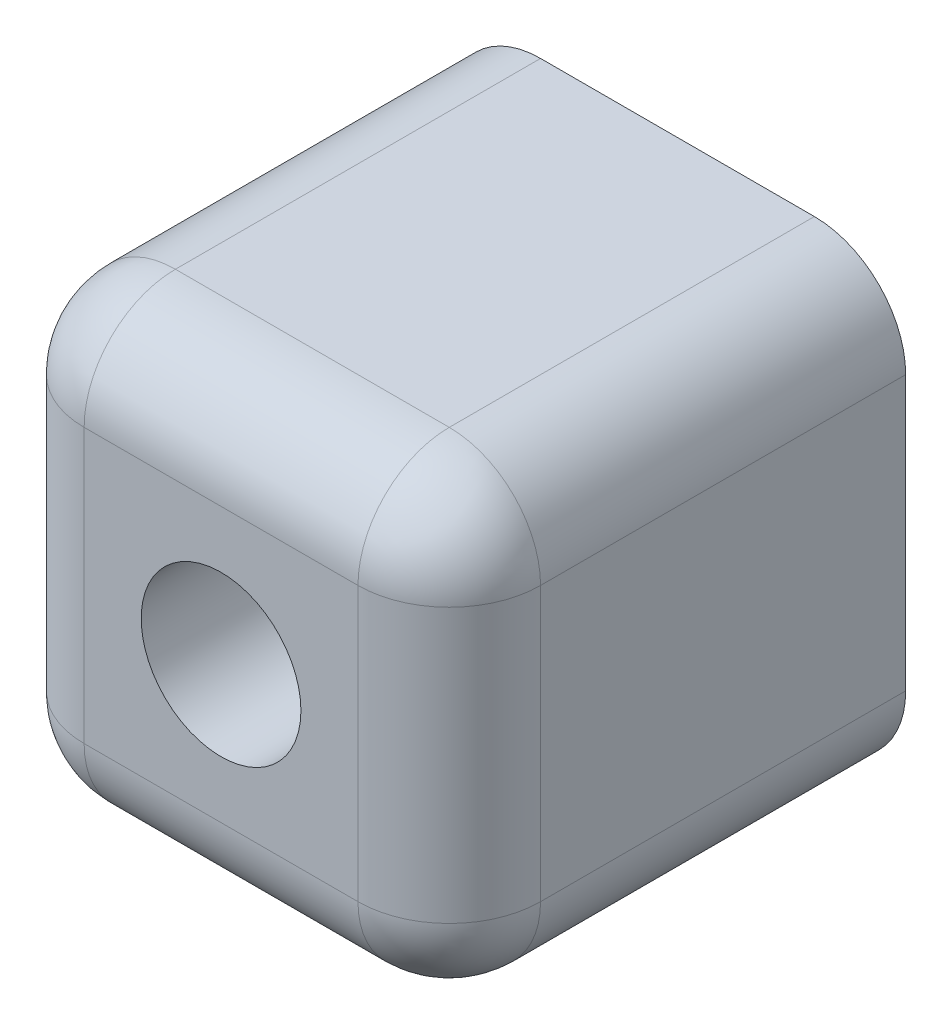
ISO-10303-21;
HEADER;
FILE_DESCRIPTION(('STEP AP214'),'2;1');
FILE_NAME('part.step','',(''),(''),'','','');
FILE_SCHEMA(('AUTOMOTIVE_DESIGN { 1 0 10303 214 1 1 1 1 }'));
ENDSEC;
DATA;
#1=APPLICATION_CONTEXT('core data for automotive mechanical design processes');
#2=APPLICATION_PROTOCOL_DEFINITION('international standard','automotive_design',2000,#1);
#3=PRODUCT_CONTEXT('',#1,'mechanical');
#4=PRODUCT('Part','Part','',(#3));
#5=PRODUCT_RELATED_PRODUCT_CATEGORY('part','',(#4));
#6=PRODUCT_DEFINITION_FORMATION('','',#4);
#7=PRODUCT_DEFINITION_CONTEXT('part definition',#1,'design');
#8=PRODUCT_DEFINITION('design','',#6,#7);
#9=PRODUCT_DEFINITION_SHAPE('','',#8);
#10=(LENGTH_UNIT() NAMED_UNIT(*) SI_UNIT(.MILLI.,.METRE.));
#11=(NAMED_UNIT(*) PLANE_ANGLE_UNIT() SI_UNIT($,.RADIAN.));
#12=(NAMED_UNIT(*) SI_UNIT($,.STERADIAN.) SOLID_ANGLE_UNIT());
#13=UNCERTAINTY_MEASURE_WITH_UNIT(LENGTH_MEASURE(1.E-05),#10,'distance_accuracy_value','');
#14=(GEOMETRIC_REPRESENTATION_CONTEXT(3) GLOBAL_UNCERTAINTY_ASSIGNED_CONTEXT((#13)) GLOBAL_UNIT_ASSIGNED_CONTEXT((#10,
#11,#12)) REPRESENTATION_CONTEXT('',''));
#15=CARTESIAN_POINT('',(0.,0.,0.));
#16=DIRECTION('',(0.,0.,1.));
#17=DIRECTION('',(1.,0.,0.));
#18=AXIS2_PLACEMENT_3D('',#15,#16,#17);
#19=CARTESIAN_POINT('',(5.,5.,0.));
#20=DIRECTION('',(0.,0.,1.));
#21=DIRECTION('',(1.,0.,0.));
#22=AXIS2_PLACEMENT_3D('',#19,#20,#21);
#23=CYLINDRICAL_SURFACE('',#22,1.75);
#24=CARTESIAN_POINT('',(5.,5.,10.));
#25=DIRECTION('',(0.,0.,1.));
#26=DIRECTION('',(1.,0.,0.));
#27=AXIS2_PLACEMENT_3D('',#24,#25,#26);
#28=CIRCLE('',#27,1.75);
#29=CARTESIAN_POINT('',(6.75,5.,10.));
#30=VERTEX_POINT('',#29);
#31=EDGE_CURVE('E150',#30,#30,#28,.T.);
#32=ORIENTED_EDGE('',*,*,#31,.T.);
#33=EDGE_LOOP('',(#32));
#34=FACE_BOUND('',#33,.T.);
#35=CARTESIAN_POINT('',(5.,5.,5.));
#36=DIRECTION('',(0.,0.,-1.));
#37=DIRECTION('',(-1.,0.,0.));
#38=AXIS2_PLACEMENT_3D('',#35,#36,#37);
#39=CIRCLE('',#38,1.75);
#40=CARTESIAN_POINT('',(3.25,5.,5.));
#41=VERTEX_POINT('',#40);
#42=EDGE_CURVE('E148',#41,#41,#39,.F.);
#43=ORIENTED_EDGE('',*,*,#42,.F.);
#44=EDGE_LOOP('',(#43));
#45=FACE_BOUND('',#44,.T.);
#46=ADVANCED_FACE('F35',(#34,#45),#23,.F.);
#47=CARTESIAN_POINT('',(0.,0.,10.));
#48=DIRECTION('',(1.,0.,0.));
#49=DIRECTION('',(0.,0.,-1.));
#50=AXIS2_PLACEMENT_3D('',#47,#48,#49);
#51=PLANE('',#50);
#52=DIRECTION('',(0.,0.,-1.));
#53=VECTOR('',#52,1.);
#54=CARTESIAN_POINT('',(0.,2.,10.));
#55=LINE('',#54,#53);
#56=CARTESIAN_POINT('',(0.,2.,0.));
#57=VERTEX_POINT('',#56);
#58=CARTESIAN_POINT('',(0.,2.,8.));
#59=VERTEX_POINT('',#58);
#60=EDGE_CURVE('E159',#57,#59,#55,.F.);
#61=ORIENTED_EDGE('',*,*,#60,.T.);
#62=DIRECTION('',(0.,-1.,0.));
#63=VECTOR('',#62,1.);
#64=CARTESIAN_POINT('',(0.,0.,8.));
#65=LINE('',#64,#63);
#66=CARTESIAN_POINT('',(0.,8.,8.));
#67=VERTEX_POINT('',#66);
#68=EDGE_CURVE('E180',#59,#67,#65,.F.);
#69=ORIENTED_EDGE('',*,*,#68,.T.);
#70=DIRECTION('',(0.,0.,-1.));
#71=VECTOR('',#70,1.);
#72=CARTESIAN_POINT('',(0.,8.,10.));
#73=LINE('',#72,#71);
#74=CARTESIAN_POINT('',(0.,8.,0.));
#75=VERTEX_POINT('',#74);
#76=EDGE_CURVE('E162',#67,#75,#73,.T.);
#77=ORIENTED_EDGE('',*,*,#76,.T.);
#78=DIRECTION('',(0.,-1.,0.));
#79=VECTOR('',#78,1.);
#80=CARTESIAN_POINT('',(0.,0.,0.));
#81=LINE('',#80,#79);
#82=EDGE_CURVE('E223',#75,#57,#81,.T.);
#83=ORIENTED_EDGE('',*,*,#82,.T.);
#84=EDGE_LOOP('',(#61,#69,#77,#83));
#85=FACE_BOUND('',#84,.T.);
#86=ADVANCED_FACE('F259',(#85),#51,.F.);
#87=CARTESIAN_POINT('',(0.,0.,10.));
#88=DIRECTION('',(0.,1.,0.));
#89=DIRECTION('',(0.,0.,1.));
#90=AXIS2_PLACEMENT_3D('',#87,#88,#89);
#91=PLANE('',#90);
#92=DIRECTION('',(0.,0.,-1.));
#93=VECTOR('',#92,1.);
#94=CARTESIAN_POINT('',(8.,0.,10.));
#95=LINE('',#94,#93);
#96=CARTESIAN_POINT('',(8.,0.,0.));
#97=VERTEX_POINT('',#96);
#98=CARTESIAN_POINT('',(8.,0.,8.));
#99=VERTEX_POINT('',#98);
#100=EDGE_CURVE('E164',#97,#99,#95,.F.);
#101=ORIENTED_EDGE('',*,*,#100,.T.);
#102=DIRECTION('',(1.,0.,0.));
#103=VECTOR('',#102,1.);
#104=CARTESIAN_POINT('',(0.,0.,8.));
#105=LINE('',#104,#103);
#106=CARTESIAN_POINT('',(2.,0.,8.));
#107=VERTEX_POINT('',#106);
#108=EDGE_CURVE('E11',#99,#107,#105,.F.);
#109=ORIENTED_EDGE('',*,*,#108,.T.);
#110=DIRECTION('',(0.,0.,-1.));
#111=VECTOR('',#110,1.);
#112=CARTESIAN_POINT('',(2.,0.,10.));
#113=LINE('',#112,#111);
#114=CARTESIAN_POINT('',(2.,0.,0.));
#115=VERTEX_POINT('',#114);
#116=EDGE_CURVE('E166',#107,#115,#113,.T.);
#117=ORIENTED_EDGE('',*,*,#116,.T.);
#118=DIRECTION('',(1.,0.,0.));
#119=VECTOR('',#118,1.);
#120=CARTESIAN_POINT('',(0.,0.,0.));
#121=LINE('',#120,#119);
#122=EDGE_CURVE('E144',#115,#97,#121,.T.);
#123=ORIENTED_EDGE('',*,*,#122,.T.);
#124=EDGE_LOOP('',(#101,#109,#117,#123));
#125=FACE_BOUND('',#124,.T.);
#126=ADVANCED_FACE('F228',(#125),#91,.F.);
#127=CARTESIAN_POINT('',(10.,0.,10.));
#128=DIRECTION('',(-1.,0.,0.));
#129=DIRECTION('',(0.,0.,1.));
#130=AXIS2_PLACEMENT_3D('',#127,#128,#129);
#131=PLANE('',#130);
#132=DIRECTION('',(0.,0.,-1.));
#133=VECTOR('',#132,1.);
#134=CARTESIAN_POINT('',(10.,8.,10.));
#135=LINE('',#134,#133);
#136=CARTESIAN_POINT('',(10.,8.,0.));
#137=VERTEX_POINT('',#136);
#138=CARTESIAN_POINT('',(10.,8.,8.));
#139=VERTEX_POINT('',#138);
#140=EDGE_CURVE('E131',#137,#139,#135,.F.);
#141=ORIENTED_EDGE('',*,*,#140,.T.);
#142=DIRECTION('',(0.,1.,0.));
#143=VECTOR('',#142,1.);
#144=CARTESIAN_POINT('',(10.,0.,8.));
#145=LINE('',#144,#143);
#146=CARTESIAN_POINT('',(10.,2.,8.));
#147=VERTEX_POINT('',#146);
#148=EDGE_CURVE('E59',#139,#147,#145,.F.);
#149=ORIENTED_EDGE('',*,*,#148,.T.);
#150=DIRECTION('',(0.,0.,-1.));
#151=VECTOR('',#150,1.);
#152=CARTESIAN_POINT('',(10.,2.,10.));
#153=LINE('',#152,#151);
#154=CARTESIAN_POINT('',(10.,2.,0.));
#155=VERTEX_POINT('',#154);
#156=EDGE_CURVE('E135',#147,#155,#153,.T.);
#157=ORIENTED_EDGE('',*,*,#156,.T.);
#158=DIRECTION('',(0.,1.,0.));
#159=VECTOR('',#158,1.);
#160=CARTESIAN_POINT('',(10.,0.,0.));
#161=LINE('',#160,#159);
#162=EDGE_CURVE('E141',#155,#137,#161,.T.);
#163=ORIENTED_EDGE('',*,*,#162,.T.);
#164=EDGE_LOOP('',(#141,#149,#157,#163));
#165=FACE_BOUND('',#164,.T.);
#166=ADVANCED_FACE('F235',(#165),#131,.F.);
#167=CARTESIAN_POINT('',(0.,10.,10.));
#168=DIRECTION('',(0.,-1.,0.));
#169=DIRECTION('',(0.,0.,-1.));
#170=AXIS2_PLACEMENT_3D('',#167,#168,#169);
#171=PLANE('',#170);
#172=DIRECTION('',(0.,0.,-1.));
#173=VECTOR('',#172,1.);
#174=CARTESIAN_POINT('',(2.,10.,10.));
#175=LINE('',#174,#173);
#176=CARTESIAN_POINT('',(2.,10.,0.));
#177=VERTEX_POINT('',#176);
#178=CARTESIAN_POINT('',(2.,10.,8.));
#179=VERTEX_POINT('',#178);
#180=EDGE_CURVE('E126',#177,#179,#175,.F.);
#181=ORIENTED_EDGE('',*,*,#180,.T.);
#182=DIRECTION('',(-1.,0.,0.));
#183=VECTOR('',#182,1.);
#184=CARTESIAN_POINT('',(0.,10.,8.));
#185=LINE('',#184,#183);
#186=CARTESIAN_POINT('',(8.,10.,8.));
#187=VERTEX_POINT('',#186);
#188=EDGE_CURVE('E122',#179,#187,#185,.F.);
#189=ORIENTED_EDGE('',*,*,#188,.T.);
#190=DIRECTION('',(0.,0.,-1.));
#191=VECTOR('',#190,1.);
#192=CARTESIAN_POINT('',(8.,10.,10.));
#193=LINE('',#192,#191);
#194=CARTESIAN_POINT('',(8.,10.,0.));
#195=VERTEX_POINT('',#194);
#196=EDGE_CURVE('E114',#187,#195,#193,.T.);
#197=ORIENTED_EDGE('',*,*,#196,.T.);
#198=DIRECTION('',(-1.,0.,0.));
#199=VECTOR('',#198,1.);
#200=CARTESIAN_POINT('',(0.,10.,0.));
#201=LINE('',#200,#199);
#202=EDGE_CURVE('E119',#195,#177,#201,.T.);
#203=ORIENTED_EDGE('',*,*,#202,.T.);
#204=EDGE_LOOP('',(#181,#189,#197,#203));
#205=FACE_BOUND('',#204,.T.);
#206=ADVANCED_FACE('F117',(#205),#171,.F.);
#207=CARTESIAN_POINT('',(0.,0.,10.));
#208=DIRECTION('',(0.,0.,-1.));
#209=DIRECTION('',(-1.,0.,0.));
#210=AXIS2_PLACEMENT_3D('',#207,#208,#209);
#211=PLANE('',#210);
#212=DIRECTION('',(-1.,0.,0.));
#213=VECTOR('',#212,1.);
#214=CARTESIAN_POINT('',(0.,8.,10.));
#215=LINE('',#214,#213);
#216=CARTESIAN_POINT('',(8.,8.,10.));
#217=VERTEX_POINT('',#216);
#218=CARTESIAN_POINT('',(2.,8.,10.));
#219=VERTEX_POINT('',#218);
#220=EDGE_CURVE('E175',#217,#219,#215,.T.);
#221=ORIENTED_EDGE('',*,*,#220,.T.);
#222=DIRECTION('',(0.,-1.,0.));
#223=VECTOR('',#222,1.);
#224=CARTESIAN_POINT('',(2.,0.,10.));
#225=LINE('',#224,#223);
#226=CARTESIAN_POINT('',(2.,2.,10.));
#227=VERTEX_POINT('',#226);
#228=EDGE_CURVE('E177',#219,#227,#225,.T.);
#229=ORIENTED_EDGE('',*,*,#228,.T.);
#230=DIRECTION('',(1.,0.,0.));
#231=VECTOR('',#230,1.);
#232=CARTESIAN_POINT('',(0.,2.,10.));
#233=LINE('',#232,#231);
#234=CARTESIAN_POINT('',(8.,2.,10.));
#235=VERTEX_POINT('',#234);
#236=EDGE_CURVE('E171',#227,#235,#233,.T.);
#237=ORIENTED_EDGE('',*,*,#236,.T.);
#238=DIRECTION('',(0.,1.,0.));
#239=VECTOR('',#238,1.);
#240=CARTESIAN_POINT('',(8.,0.,10.));
#241=LINE('',#240,#239);
#242=EDGE_CURVE('E173',#235,#217,#241,.T.);
#243=ORIENTED_EDGE('',*,*,#242,.T.);
#244=EDGE_LOOP('',(#221,#229,#237,#243));
#245=FACE_BOUND('',#244,.T.);
#246=ORIENTED_EDGE('',*,*,#31,.F.);
#247=EDGE_LOOP('',(#246));
#248=FACE_BOUND('',#247,.T.);
#249=ADVANCED_FACE('F268',(#245,#248),#211,.F.);
#250=CARTESIAN_POINT('',(0.,0.,0.));
#251=DIRECTION('',(0.,0.,-1.));
#252=DIRECTION('',(-1.,0.,0.));
#253=AXIS2_PLACEMENT_3D('',#250,#251,#252);
#254=PLANE('',#253);
#255=CARTESIAN_POINT('',(5.,5.,0.));
#256=DIRECTION('',(0.,0.,-1.));
#257=DIRECTION('',(-1.,0.,0.));
#258=AXIS2_PLACEMENT_3D('',#255,#256,#257);
#259=CIRCLE('',#258,2.05);
#260=CARTESIAN_POINT('',(2.95,5.,0.));
#261=VERTEX_POINT('',#260);
#262=EDGE_CURVE('E211',#261,#261,#259,.T.);
#263=ORIENTED_EDGE('',*,*,#262,.F.);
#264=EDGE_LOOP('',(#263));
#265=FACE_BOUND('',#264,.T.);
#266=ORIENTED_EDGE('',*,*,#202,.F.);
#267=CARTESIAN_POINT('',(8.,8.,0.));
#268=DIRECTION('',(0.,0.,-1.));
#269=DIRECTION('',(-1.,0.,0.));
#270=AXIS2_PLACEMENT_3D('',#267,#268,#269);
#271=CIRCLE('',#270,2.);
#272=EDGE_CURVE('E129',#195,#137,#271,.T.);
#273=ORIENTED_EDGE('',*,*,#272,.T.);
#274=ORIENTED_EDGE('',*,*,#162,.F.);
#275=CARTESIAN_POINT('',(8.,2.,0.));
#276=DIRECTION('',(0.,0.,-1.));
#277=DIRECTION('',(-1.,0.,0.));
#278=AXIS2_PLACEMENT_3D('',#275,#276,#277);
#279=CIRCLE('',#278,2.);
#280=EDGE_CURVE('E125',#155,#97,#279,.T.);
#281=ORIENTED_EDGE('',*,*,#280,.T.);
#282=ORIENTED_EDGE('',*,*,#122,.F.);
#283=CARTESIAN_POINT('',(2.,2.,0.));
#284=DIRECTION('',(0.,0.,-1.));
#285=DIRECTION('',(-1.,0.,0.));
#286=AXIS2_PLACEMENT_3D('',#283,#284,#285);
#287=CIRCLE('',#286,2.);
#288=EDGE_CURVE('E154',#115,#57,#287,.T.);
#289=ORIENTED_EDGE('',*,*,#288,.T.);
#290=ORIENTED_EDGE('',*,*,#82,.F.);
#291=CARTESIAN_POINT('',(2.,8.,0.));
#292=DIRECTION('',(0.,0.,-1.));
#293=DIRECTION('',(-1.,0.,0.));
#294=AXIS2_PLACEMENT_3D('',#291,#292,#293);
#295=CIRCLE('',#294,2.);
#296=EDGE_CURVE('E136',#75,#177,#295,.T.);
#297=ORIENTED_EDGE('',*,*,#296,.T.);
#298=EDGE_LOOP('',(#266,#273,#274,#281,#282,#289,#290,#297));
#299=FACE_BOUND('',#298,.T.);
#300=ADVANCED_FACE('F138',(#265,#299),#254,.T.);
#301=CARTESIAN_POINT('',(5.,5.,5.));
#302=DIRECTION('',(0.,0.,-1.));
#303=DIRECTION('',(-1.,0.,0.));
#304=AXIS2_PLACEMENT_3D('',#301,#302,#303);
#305=PLANE('',#304);
#306=CARTESIAN_POINT('',(5.,5.,5.));
#307=DIRECTION('',(0.,0.,-1.));
#308=DIRECTION('',(-1.,0.,0.));
#309=AXIS2_PLACEMENT_3D('',#306,#307,#308);
#310=CIRCLE('',#309,2.05);
#311=CARTESIAN_POINT('',(2.95,5.,5.));
#312=VERTEX_POINT('',#311);
#313=EDGE_CURVE('E151',#312,#312,#310,.T.);
#314=ORIENTED_EDGE('',*,*,#313,.T.);
#315=EDGE_LOOP('',(#314));
#316=FACE_BOUND('',#315,.T.);
#317=ORIENTED_EDGE('',*,*,#42,.T.);
#318=EDGE_LOOP('',(#317));
#319=FACE_BOUND('',#318,.T.);
#320=ADVANCED_FACE('F279',(#316,#319),#305,.T.);
#321=CARTESIAN_POINT('',(5.,5.,5.));
#322=DIRECTION('',(0.,0.,-1.));
#323=DIRECTION('',(-1.,0.,0.));
#324=AXIS2_PLACEMENT_3D('',#321,#322,#323);
#325=CYLINDRICAL_SURFACE('',#324,2.05);
#326=ORIENTED_EDGE('',*,*,#313,.F.);
#327=EDGE_LOOP('',(#326));
#328=FACE_BOUND('',#327,.T.);
#329=ORIENTED_EDGE('',*,*,#262,.T.);
#330=EDGE_LOOP('',(#329));
#331=FACE_BOUND('',#330,.T.);
#332=ADVANCED_FACE('F281',(#328,#331),#325,.F.);
#333=CARTESIAN_POINT('',(8.,8.,10.));
#334=DIRECTION('',(0.,0.,-1.));
#335=DIRECTION('',(-1.,0.,0.));
#336=AXIS2_PLACEMENT_3D('',#333,#334,#335);
#337=CYLINDRICAL_SURFACE('',#336,2.);
#338=ORIENTED_EDGE('',*,*,#196,.F.);
#339=CARTESIAN_POINT('',(8.,8.,8.));
#340=DIRECTION('',(0.,0.,-1.));
#341=DIRECTION('',(-1.,0.,0.));
#342=AXIS2_PLACEMENT_3D('',#339,#340,#341);
#343=CIRCLE('',#342,2.);
#344=EDGE_CURVE('E185',#187,#139,#343,.T.);
#345=ORIENTED_EDGE('',*,*,#344,.T.);
#346=ORIENTED_EDGE('',*,*,#140,.F.);
#347=ORIENTED_EDGE('',*,*,#272,.F.);
#348=EDGE_LOOP('',(#338,#345,#346,#347));
#349=FACE_BOUND('',#348,.T.);
#350=ADVANCED_FACE('F130',(#349),#337,.T.);
#351=CARTESIAN_POINT('',(2.,8.,10.));
#352=DIRECTION('',(0.,0.,-1.));
#353=DIRECTION('',(-1.,0.,0.));
#354=AXIS2_PLACEMENT_3D('',#351,#352,#353);
#355=CYLINDRICAL_SURFACE('',#354,2.);
#356=ORIENTED_EDGE('',*,*,#76,.F.);
#357=CARTESIAN_POINT('',(2.,8.,8.));
#358=DIRECTION('',(0.,0.,-1.));
#359=DIRECTION('',(-1.,0.,0.));
#360=AXIS2_PLACEMENT_3D('',#357,#358,#359);
#361=CIRCLE('',#360,2.);
#362=EDGE_CURVE('E182',#67,#179,#361,.T.);
#363=ORIENTED_EDGE('',*,*,#362,.T.);
#364=ORIENTED_EDGE('',*,*,#180,.F.);
#365=ORIENTED_EDGE('',*,*,#296,.F.);
#366=EDGE_LOOP('',(#356,#363,#364,#365));
#367=FACE_BOUND('',#366,.T.);
#368=ADVANCED_FACE('F262',(#367),#355,.T.);
#369=CARTESIAN_POINT('',(2.,2.,10.));
#370=DIRECTION('',(0.,0.,-1.));
#371=DIRECTION('',(-1.,0.,0.));
#372=AXIS2_PLACEMENT_3D('',#369,#370,#371);
#373=CYLINDRICAL_SURFACE('',#372,2.);
#374=ORIENTED_EDGE('',*,*,#116,.F.);
#375=CARTESIAN_POINT('',(2.,2.,8.));
#376=DIRECTION('',(0.,0.,-1.));
#377=DIRECTION('',(-1.,0.,0.));
#378=AXIS2_PLACEMENT_3D('',#375,#376,#377);
#379=CIRCLE('',#378,2.);
#380=EDGE_CURVE('E168',#107,#59,#379,.T.);
#381=ORIENTED_EDGE('',*,*,#380,.T.);
#382=ORIENTED_EDGE('',*,*,#60,.F.);
#383=ORIENTED_EDGE('',*,*,#288,.F.);
#384=EDGE_LOOP('',(#374,#381,#382,#383));
#385=FACE_BOUND('',#384,.T.);
#386=ADVANCED_FACE('F247',(#385),#373,.T.);
#387=CARTESIAN_POINT('',(8.,2.,10.));
#388=DIRECTION('',(0.,0.,-1.));
#389=DIRECTION('',(-1.,0.,0.));
#390=AXIS2_PLACEMENT_3D('',#387,#388,#389);
#391=CYLINDRICAL_SURFACE('',#390,2.);
#392=ORIENTED_EDGE('',*,*,#156,.F.);
#393=CARTESIAN_POINT('',(8.,2.,8.));
#394=DIRECTION('',(0.,0.,-1.));
#395=DIRECTION('',(-1.,0.,0.));
#396=AXIS2_PLACEMENT_3D('',#393,#394,#395);
#397=CIRCLE('',#396,2.);
#398=EDGE_CURVE('E44',#147,#99,#397,.T.);
#399=ORIENTED_EDGE('',*,*,#398,.T.);
#400=ORIENTED_EDGE('',*,*,#100,.F.);
#401=ORIENTED_EDGE('',*,*,#280,.F.);
#402=EDGE_LOOP('',(#392,#399,#400,#401));
#403=FACE_BOUND('',#402,.T.);
#404=ADVANCED_FACE('F233',(#403),#391,.T.);
#405=CARTESIAN_POINT('',(8.,8.,8.));
#406=DIRECTION('',(0.,0.,1.));
#407=DIRECTION('',(1.,0.,0.));
#408=AXIS2_PLACEMENT_3D('',#405,#406,#407);
#409=SPHERICAL_SURFACE('',#408,2.);
#410=CARTESIAN_POINT('',(8.,8.,8.));
#411=DIRECTION('',(0.,-1.,0.));
#412=DIRECTION('',(0.,0.,-1.));
#413=AXIS2_PLACEMENT_3D('',#410,#411,#412);
#414=CIRCLE('',#413,2.);
#415=EDGE_CURVE('E204',#139,#217,#414,.T.);
#416=ORIENTED_EDGE('',*,*,#415,.F.);
#417=ORIENTED_EDGE('',*,*,#344,.F.);
#418=CARTESIAN_POINT('',(8.,8.,8.));
#419=DIRECTION('',(-1.,0.,0.));
#420=DIRECTION('',(0.,0.,1.));
#421=AXIS2_PLACEMENT_3D('',#418,#419,#420);
#422=CIRCLE('',#421,2.);
#423=EDGE_CURVE('E39',#217,#187,#422,.T.);
#424=ORIENTED_EDGE('',*,*,#423,.F.);
#425=EDGE_LOOP('',(#416,#417,#424));
#426=FACE_BOUND('',#425,.T.);
#427=ADVANCED_FACE('F37',(#426),#409,.T.);
#428=CARTESIAN_POINT('',(0.,8.,8.));
#429=DIRECTION('',(-1.,0.,0.));
#430=DIRECTION('',(0.,0.,1.));
#431=AXIS2_PLACEMENT_3D('',#428,#429,#430);
#432=CYLINDRICAL_SURFACE('',#431,2.);
#433=ORIENTED_EDGE('',*,*,#423,.T.);
#434=ORIENTED_EDGE('',*,*,#188,.F.);
#435=CARTESIAN_POINT('',(2.,8.,8.));
#436=DIRECTION('',(-1.,0.,0.));
#437=DIRECTION('',(0.,0.,1.));
#438=AXIS2_PLACEMENT_3D('',#435,#436,#437);
#439=CIRCLE('',#438,2.);
#440=EDGE_CURVE('E202',#219,#179,#439,.T.);
#441=ORIENTED_EDGE('',*,*,#440,.F.);
#442=ORIENTED_EDGE('',*,*,#220,.F.);
#443=EDGE_LOOP('',(#433,#434,#441,#442));
#444=FACE_BOUND('',#443,.T.);
#445=ADVANCED_FACE('F266',(#444),#432,.T.);
#446=CARTESIAN_POINT('',(8.,0.,8.));
#447=DIRECTION('',(0.,1.,0.));
#448=DIRECTION('',(0.,0.,1.));
#449=AXIS2_PLACEMENT_3D('',#446,#447,#448);
#450=CYLINDRICAL_SURFACE('',#449,2.);
#451=ORIENTED_EDGE('',*,*,#415,.T.);
#452=ORIENTED_EDGE('',*,*,#242,.F.);
#453=CARTESIAN_POINT('',(8.,2.,8.));
#454=DIRECTION('',(0.,-1.,0.));
#455=DIRECTION('',(0.,0.,-1.));
#456=AXIS2_PLACEMENT_3D('',#453,#454,#455);
#457=CIRCLE('',#456,2.);
#458=EDGE_CURVE('E199',#147,#235,#457,.T.);
#459=ORIENTED_EDGE('',*,*,#458,.F.);
#460=ORIENTED_EDGE('',*,*,#148,.F.);
#461=EDGE_LOOP('',(#451,#452,#459,#460));
#462=FACE_BOUND('',#461,.T.);
#463=ADVANCED_FACE('F237',(#462),#450,.T.);
#464=CARTESIAN_POINT('',(2.,8.,8.));
#465=DIRECTION('',(0.,0.,1.));
#466=DIRECTION('',(1.,0.,0.));
#467=AXIS2_PLACEMENT_3D('',#464,#465,#466);
#468=SPHERICAL_SURFACE('',#467,2.);
#469=ORIENTED_EDGE('',*,*,#440,.T.);
#470=ORIENTED_EDGE('',*,*,#362,.F.);
#471=CARTESIAN_POINT('',(2.,8.,8.));
#472=DIRECTION('',(0.,-1.,0.));
#473=DIRECTION('',(0.,0.,-1.));
#474=AXIS2_PLACEMENT_3D('',#471,#472,#473);
#475=CIRCLE('',#474,2.);
#476=EDGE_CURVE('E196',#219,#67,#475,.T.);
#477=ORIENTED_EDGE('',*,*,#476,.F.);
#478=EDGE_LOOP('',(#469,#470,#477));
#479=FACE_BOUND('',#478,.T.);
#480=ADVANCED_FACE('F264',(#479),#468,.T.);
#481=CARTESIAN_POINT('',(8.,2.,8.));
#482=DIRECTION('',(0.,0.,1.));
#483=DIRECTION('',(1.,0.,0.));
#484=AXIS2_PLACEMENT_3D('',#481,#482,#483);
#485=SPHERICAL_SURFACE('',#484,2.);
#486=ORIENTED_EDGE('',*,*,#398,.F.);
#487=ORIENTED_EDGE('',*,*,#458,.T.);
#488=CARTESIAN_POINT('',(8.,2.,8.));
#489=DIRECTION('',(-1.,0.,0.));
#490=DIRECTION('',(0.,0.,1.));
#491=AXIS2_PLACEMENT_3D('',#488,#489,#490);
#492=CIRCLE('',#491,2.);
#493=EDGE_CURVE('E193',#99,#235,#492,.T.);
#494=ORIENTED_EDGE('',*,*,#493,.F.);
#495=EDGE_LOOP('',(#486,#487,#494));
#496=FACE_BOUND('',#495,.T.);
#497=ADVANCED_FACE('F239',(#496),#485,.T.);
#498=CARTESIAN_POINT('',(2.,0.,8.));
#499=DIRECTION('',(0.,-1.,0.));
#500=DIRECTION('',(0.,0.,-1.));
#501=AXIS2_PLACEMENT_3D('',#498,#499,#500);
#502=CYLINDRICAL_SURFACE('',#501,2.);
#503=ORIENTED_EDGE('',*,*,#476,.T.);
#504=ORIENTED_EDGE('',*,*,#68,.F.);
#505=CARTESIAN_POINT('',(2.,2.,8.));
#506=DIRECTION('',(0.,-1.,0.));
#507=DIRECTION('',(0.,0.,-1.));
#508=AXIS2_PLACEMENT_3D('',#505,#506,#507);
#509=CIRCLE('',#508,2.);
#510=EDGE_CURVE('E191',#227,#59,#509,.T.);
#511=ORIENTED_EDGE('',*,*,#510,.F.);
#512=ORIENTED_EDGE('',*,*,#228,.F.);
#513=EDGE_LOOP('',(#503,#504,#511,#512));
#514=FACE_BOUND('',#513,.T.);
#515=ADVANCED_FACE('F255',(#514),#502,.T.);
#516=CARTESIAN_POINT('',(0.,2.,8.));
#517=DIRECTION('',(1.,0.,0.));
#518=DIRECTION('',(0.,0.,-1.));
#519=AXIS2_PLACEMENT_3D('',#516,#517,#518);
#520=CYLINDRICAL_SURFACE('',#519,2.);
#521=ORIENTED_EDGE('',*,*,#493,.T.);
#522=ORIENTED_EDGE('',*,*,#236,.F.);
#523=CARTESIAN_POINT('',(2.,2.,8.));
#524=DIRECTION('',(-1.,0.,0.));
#525=DIRECTION('',(0.,0.,1.));
#526=AXIS2_PLACEMENT_3D('',#523,#524,#525);
#527=CIRCLE('',#526,2.);
#528=EDGE_CURVE('E189',#107,#227,#527,.T.);
#529=ORIENTED_EDGE('',*,*,#528,.F.);
#530=ORIENTED_EDGE('',*,*,#108,.F.);
#531=EDGE_LOOP('',(#521,#522,#529,#530));
#532=FACE_BOUND('',#531,.T.);
#533=ADVANCED_FACE('F244',(#532),#520,.T.);
#534=CARTESIAN_POINT('',(2.,2.,8.));
#535=DIRECTION('',(0.,0.,1.));
#536=DIRECTION('',(1.,0.,0.));
#537=AXIS2_PLACEMENT_3D('',#534,#535,#536);
#538=SPHERICAL_SURFACE('',#537,2.);
#539=ORIENTED_EDGE('',*,*,#510,.T.);
#540=ORIENTED_EDGE('',*,*,#380,.F.);
#541=ORIENTED_EDGE('',*,*,#528,.T.);
#542=EDGE_LOOP('',(#539,#540,#541));
#543=FACE_BOUND('',#542,.T.);
#544=ADVANCED_FACE('F250',(#543),#538,.T.);
#545=CLOSED_SHELL('',(#46,#86,#126,#166,#206,#249,#300,#320,#332,#350,#368,#386,#404,#427,#445,
#463,#480,#497,#515,#533,#544));
#546=MANIFOLD_SOLID_BREP('B2',#545);
#547=ADVANCED_BREP_SHAPE_REPRESENTATION('',(#18,#546),#14);
#548=SHAPE_DEFINITION_REPRESENTATION(#9,#547);
ENDSEC;
END-ISO-10303-21;
